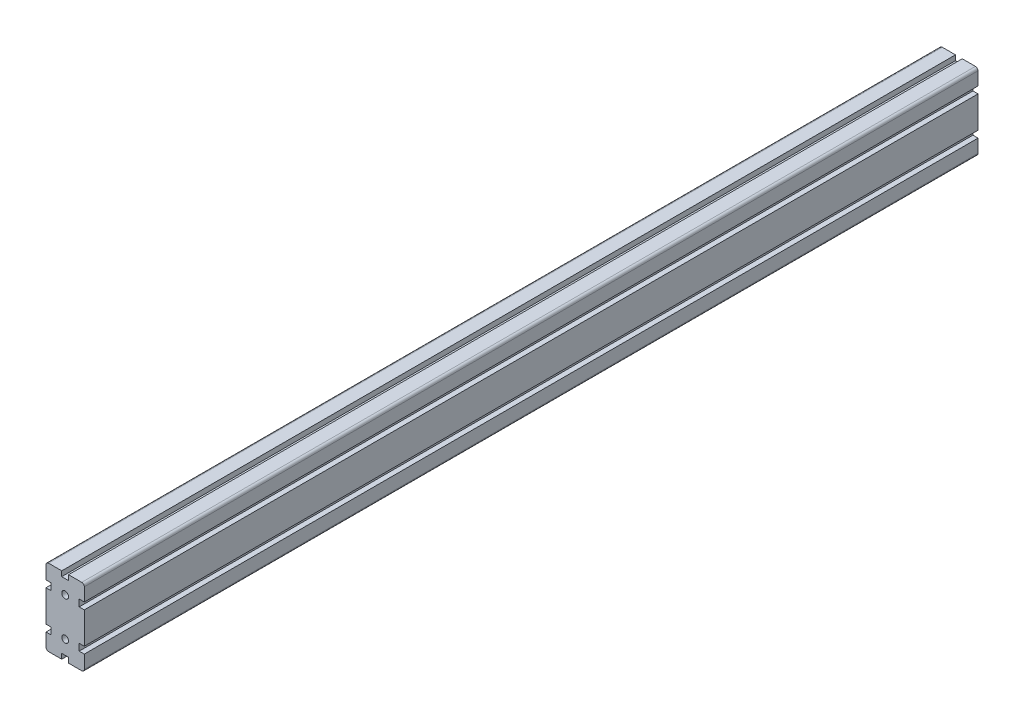
ISO-10303-21;
HEADER;
FILE_DESCRIPTION(('STEP AP214'),'2;1');
FILE_NAME('part.step','',(''),(''),'','','');
FILE_SCHEMA(('AUTOMOTIVE_DESIGN { 1 0 10303 214 1 1 1 1 }'));
ENDSEC;
DATA;
#1=APPLICATION_CONTEXT('core data for automotive mechanical design processes');
#2=APPLICATION_PROTOCOL_DEFINITION('international standard','automotive_design',2000,#1);
#3=PRODUCT_CONTEXT('',#1,'mechanical');
#4=PRODUCT('Part','Part','',(#3));
#5=PRODUCT_RELATED_PRODUCT_CATEGORY('part','',(#4));
#6=PRODUCT_DEFINITION_FORMATION('','',#4);
#7=PRODUCT_DEFINITION_CONTEXT('part definition',#1,'design');
#8=PRODUCT_DEFINITION('design','',#6,#7);
#9=PRODUCT_DEFINITION_SHAPE('','',#8);
#10=(LENGTH_UNIT() NAMED_UNIT(*) SI_UNIT(.MILLI.,.METRE.));
#11=(NAMED_UNIT(*) PLANE_ANGLE_UNIT() SI_UNIT($,.RADIAN.));
#12=(NAMED_UNIT(*) SI_UNIT($,.STERADIAN.) SOLID_ANGLE_UNIT());
#13=UNCERTAINTY_MEASURE_WITH_UNIT(LENGTH_MEASURE(1.E-05),#10,'distance_accuracy_value','');
#14=(GEOMETRIC_REPRESENTATION_CONTEXT(3) GLOBAL_UNCERTAINTY_ASSIGNED_CONTEXT((#13)) GLOBAL_UNIT_ASSIGNED_CONTEXT((#10,
#11,#12)) REPRESENTATION_CONTEXT('',''));
#15=CARTESIAN_POINT('',(0.,0.,0.));
#16=DIRECTION('',(0.,0.,1.));
#17=DIRECTION('',(1.,0.,0.));
#18=AXIS2_PLACEMENT_3D('',#15,#16,#17);
#19=CARTESIAN_POINT('',(-16.5000000000007,26.5000000000001,50.));
#20=DIRECTION('',(-1.,0.,0.));
#21=DIRECTION('',(0.,0.,1.));
#22=AXIS2_PLACEMENT_3D('',#19,#20,#21);
#23=PLANE('',#22);
#24=DIRECTION('',(0.,1.,0.));
#25=VECTOR('',#24,1.);
#26=CARTESIAN_POINT('',(-16.5000000000007,26.5000000000001,-1000.));
#27=LINE('',#26,#25);
#28=CARTESIAN_POINT('',(-16.5000000000007,18.4999999999999,-1000.));
#29=VERTEX_POINT('',#28);
#30=CARTESIAN_POINT('',(-16.5000000000007,26.5000000000001,-1000.));
#31=VERTEX_POINT('',#30);
#32=EDGE_CURVE('E274',#29,#31,#27,.T.);
#33=ORIENTED_EDGE('',*,*,#32,.F.);
#34=DIRECTION('',(0.,0.,-1.));
#35=VECTOR('',#34,1.);
#36=CARTESIAN_POINT('',(-16.5000000000007,18.4999999999999,50.));
#37=LINE('',#36,#35);
#38=CARTESIAN_POINT('',(-16.5000000000007,18.4999999999999,50.));
#39=VERTEX_POINT('',#38);
#40=EDGE_CURVE('E11',#39,#29,#37,.T.);
#41=ORIENTED_EDGE('',*,*,#40,.F.);
#42=DIRECTION('',(0.,1.,0.));
#43=VECTOR('',#42,1.);
#44=CARTESIAN_POINT('',(-16.5000000000007,26.5000000000001,50.));
#45=LINE('',#44,#43);
#46=CARTESIAN_POINT('',(-16.5000000000007,26.5000000000001,50.));
#47=VERTEX_POINT('',#46);
#48=EDGE_CURVE('E367',#39,#47,#45,.T.);
#49=ORIENTED_EDGE('',*,*,#48,.T.);
#50=DIRECTION('',(0.,0.,-1.));
#51=VECTOR('',#50,1.);
#52=CARTESIAN_POINT('',(-16.5000000000007,26.5000000000001,50.));
#53=LINE('',#52,#51);
#54=EDGE_CURVE('E36',#47,#31,#53,.T.);
#55=ORIENTED_EDGE('',*,*,#54,.T.);
#56=EDGE_LOOP('',(#33,#41,#49,#55));
#57=FACE_BOUND('',#56,.T.);
#58=ADVANCED_FACE('F33',(#57),#23,.T.);
#59=CARTESIAN_POINT('',(-22.5,18.4999999999999,50.));
#60=DIRECTION('',(0.,1.,0.));
#61=DIRECTION('',(0.,0.,1.));
#62=AXIS2_PLACEMENT_3D('',#59,#60,#61);
#63=PLANE('',#62);
#64=DIRECTION('',(1.,0.,0.));
#65=VECTOR('',#64,1.);
#66=CARTESIAN_POINT('',(-22.5,18.4999999999999,-1000.));
#67=LINE('',#66,#65);
#68=CARTESIAN_POINT('',(-22.5,18.4999999999999,-1000.));
#69=VERTEX_POINT('',#68);
#70=EDGE_CURVE('E365',#69,#29,#67,.T.);
#71=ORIENTED_EDGE('',*,*,#70,.F.);
#72=DIRECTION('',(0.,0.,-1.));
#73=VECTOR('',#72,1.);
#74=CARTESIAN_POINT('',(-22.5,18.4999999999999,50.));
#75=LINE('',#74,#73);
#76=CARTESIAN_POINT('',(-22.5,18.4999999999999,50.));
#77=VERTEX_POINT('',#76);
#78=EDGE_CURVE('E42',#77,#69,#75,.T.);
#79=ORIENTED_EDGE('',*,*,#78,.F.);
#80=DIRECTION('',(1.,0.,0.));
#81=VECTOR('',#80,1.);
#82=CARTESIAN_POINT('',(-22.5,18.4999999999999,50.));
#83=LINE('',#82,#81);
#84=EDGE_CURVE('E264',#77,#39,#83,.T.);
#85=ORIENTED_EDGE('',*,*,#84,.T.);
#86=ORIENTED_EDGE('',*,*,#40,.T.);
#87=EDGE_LOOP('',(#71,#79,#85,#86));
#88=FACE_BOUND('',#87,.T.);
#89=ADVANCED_FACE('F427',(#88),#63,.T.);
#90=CARTESIAN_POINT('',(-22.5,-18.5,50.));
#91=DIRECTION('',(-1.,0.,0.));
#92=DIRECTION('',(0.,-1.,0.));
#93=AXIS2_PLACEMENT_3D('',#90,#91,#92);
#94=PLANE('',#93);
#95=DIRECTION('',(0.,1.,0.));
#96=VECTOR('',#95,1.);
#97=CARTESIAN_POINT('',(-22.5,-18.5,-1000.));
#98=LINE('',#97,#96);
#99=CARTESIAN_POINT('',(-22.5,-18.5,-1000.));
#100=VERTEX_POINT('',#99);
#101=EDGE_CURVE('E251',#100,#69,#98,.T.);
#102=ORIENTED_EDGE('',*,*,#101,.F.);
#103=DIRECTION('',(0.,0.,-1.));
#104=VECTOR('',#103,1.);
#105=CARTESIAN_POINT('',(-22.5,-18.5,50.));
#106=LINE('',#105,#104);
#107=CARTESIAN_POINT('',(-22.5,-18.5,50.));
#108=VERTEX_POINT('',#107);
#109=EDGE_CURVE('E246',#108,#100,#106,.T.);
#110=ORIENTED_EDGE('',*,*,#109,.F.);
#111=DIRECTION('',(0.,1.,0.));
#112=VECTOR('',#111,1.);
#113=CARTESIAN_POINT('',(-22.5,-18.5,50.));
#114=LINE('',#113,#112);
#115=EDGE_CURVE('E249',#108,#77,#114,.T.);
#116=ORIENTED_EDGE('',*,*,#115,.T.);
#117=ORIENTED_EDGE('',*,*,#78,.T.);
#118=EDGE_LOOP('',(#102,#110,#116,#117));
#119=FACE_BOUND('',#118,.T.);
#120=ADVANCED_FACE('F248',(#119),#94,.T.);
#121=CARTESIAN_POINT('',(-16.5000000000017,-18.5,50.));
#122=DIRECTION('',(0.,-1.,0.));
#123=DIRECTION('',(0.,0.,-1.));
#124=AXIS2_PLACEMENT_3D('',#121,#122,#123);
#125=PLANE('',#124);
#126=DIRECTION('',(-1.,0.,0.));
#127=VECTOR('',#126,1.);
#128=CARTESIAN_POINT('',(-16.5000000000017,-18.5,-1000.));
#129=LINE('',#128,#127);
#130=CARTESIAN_POINT('',(-16.5000000000017,-18.5,-1000.));
#131=VERTEX_POINT('',#130);
#132=EDGE_CURVE('E362',#131,#100,#129,.T.);
#133=ORIENTED_EDGE('',*,*,#132,.F.);
#134=DIRECTION('',(0.,0.,-1.));
#135=VECTOR('',#134,1.);
#136=CARTESIAN_POINT('',(-16.5000000000017,-18.5,50.));
#137=LINE('',#136,#135);
#138=CARTESIAN_POINT('',(-16.5000000000017,-18.5,50.));
#139=VERTEX_POINT('',#138);
#140=EDGE_CURVE('E256',#139,#131,#137,.T.);
#141=ORIENTED_EDGE('',*,*,#140,.F.);
#142=DIRECTION('',(-1.,0.,0.));
#143=VECTOR('',#142,1.);
#144=CARTESIAN_POINT('',(-16.5000000000017,-18.5,50.));
#145=LINE('',#144,#143);
#146=EDGE_CURVE('E262',#139,#108,#145,.T.);
#147=ORIENTED_EDGE('',*,*,#146,.T.);
#148=ORIENTED_EDGE('',*,*,#109,.T.);
#149=EDGE_LOOP('',(#133,#141,#147,#148));
#150=FACE_BOUND('',#149,.T.);
#151=ADVANCED_FACE('F266',(#150),#125,.T.);
#152=CARTESIAN_POINT('',(-16.5000000000017,-18.5,50.));
#153=DIRECTION('',(-1.,0.,0.));
#154=DIRECTION('',(0.,0.,1.));
#155=AXIS2_PLACEMENT_3D('',#152,#153,#154);
#156=PLANE('',#155);
#157=DIRECTION('',(0.,1.,0.));
#158=VECTOR('',#157,1.);
#159=CARTESIAN_POINT('',(-16.5000000000017,-18.5,-1000.));
#160=LINE('',#159,#158);
#161=CARTESIAN_POINT('',(-16.5000000000017,-26.5,-1000.));
#162=VERTEX_POINT('',#161);
#163=EDGE_CURVE('E359',#162,#131,#160,.T.);
#164=ORIENTED_EDGE('',*,*,#163,.F.);
#165=DIRECTION('',(0.,0.,-1.));
#166=VECTOR('',#165,1.);
#167=CARTESIAN_POINT('',(-16.5000000000017,-26.5,50.));
#168=LINE('',#167,#166);
#169=CARTESIAN_POINT('',(-16.5000000000017,-26.5,50.));
#170=VERTEX_POINT('',#169);
#171=EDGE_CURVE('E371',#170,#162,#168,.T.);
#172=ORIENTED_EDGE('',*,*,#171,.F.);
#173=DIRECTION('',(0.,1.,0.));
#174=VECTOR('',#173,1.);
#175=CARTESIAN_POINT('',(-16.5000000000017,-18.5,50.));
#176=LINE('',#175,#174);
#177=EDGE_CURVE('E267',#170,#139,#176,.T.);
#178=ORIENTED_EDGE('',*,*,#177,.T.);
#179=ORIENTED_EDGE('',*,*,#140,.T.);
#180=EDGE_LOOP('',(#164,#172,#178,#179));
#181=FACE_BOUND('',#180,.T.);
#182=ADVANCED_FACE('F440',(#181),#156,.T.);
#183=CARTESIAN_POINT('',(-22.5,-26.5,50.));
#184=DIRECTION('',(0.,1.,0.));
#185=DIRECTION('',(0.,0.,1.));
#186=AXIS2_PLACEMENT_3D('',#183,#184,#185);
#187=PLANE('',#186);
#188=DIRECTION('',(1.,0.,0.));
#189=VECTOR('',#188,1.);
#190=CARTESIAN_POINT('',(-22.5,-26.5,-1000.));
#191=LINE('',#190,#189);
#192=CARTESIAN_POINT('',(-22.5,-26.5,-1000.));
#193=VERTEX_POINT('',#192);
#194=EDGE_CURVE('E356',#193,#162,#191,.T.);
#195=ORIENTED_EDGE('',*,*,#194,.F.);
#196=DIRECTION('',(0.,0.,-1.));
#197=VECTOR('',#196,1.);
#198=CARTESIAN_POINT('',(-22.5,-26.5,50.));
#199=LINE('',#198,#197);
#200=CARTESIAN_POINT('',(-22.5,-26.5,50.));
#201=VERTEX_POINT('',#200);
#202=EDGE_CURVE('E373',#201,#193,#199,.T.);
#203=ORIENTED_EDGE('',*,*,#202,.F.);
#204=DIRECTION('',(1.,0.,0.));
#205=VECTOR('',#204,1.);
#206=CARTESIAN_POINT('',(-22.5,-26.5,50.));
#207=LINE('',#206,#205);
#208=EDGE_CURVE('E269',#201,#170,#207,.T.);
#209=ORIENTED_EDGE('',*,*,#208,.T.);
#210=ORIENTED_EDGE('',*,*,#171,.T.);
#211=EDGE_LOOP('',(#195,#203,#209,#210));
#212=FACE_BOUND('',#211,.T.);
#213=ADVANCED_FACE('F443',(#212),#187,.T.);
#214=CARTESIAN_POINT('',(-22.5,-42.,50.));
#215=DIRECTION('',(-1.,0.,0.));
#216=DIRECTION('',(0.,0.,1.));
#217=AXIS2_PLACEMENT_3D('',#214,#215,#216);
#218=PLANE('',#217);
#219=DIRECTION('',(0.,1.,0.));
#220=VECTOR('',#219,1.);
#221=CARTESIAN_POINT('',(-22.5,-42.,-1000.));
#222=LINE('',#221,#220);
#223=CARTESIAN_POINT('',(-22.5,-42.,-1000.));
#224=VERTEX_POINT('',#223);
#225=EDGE_CURVE('E353',#224,#193,#222,.T.);
#226=ORIENTED_EDGE('',*,*,#225,.F.);
#227=DIRECTION('',(0.,0.,-1.));
#228=VECTOR('',#227,1.);
#229=CARTESIAN_POINT('',(-22.5,-42.,50.));
#230=LINE('',#229,#228);
#231=CARTESIAN_POINT('',(-22.5,-42.,50.));
#232=VERTEX_POINT('',#231);
#233=EDGE_CURVE('E375',#232,#224,#230,.T.);
#234=ORIENTED_EDGE('',*,*,#233,.F.);
#235=DIRECTION('',(0.,1.,0.));
#236=VECTOR('',#235,1.);
#237=CARTESIAN_POINT('',(-22.5,-42.,50.));
#238=LINE('',#237,#236);
#239=EDGE_CURVE('E657',#232,#201,#238,.T.);
#240=ORIENTED_EDGE('',*,*,#239,.T.);
#241=ORIENTED_EDGE('',*,*,#202,.T.);
#242=EDGE_LOOP('',(#226,#234,#240,#241));
#243=FACE_BOUND('',#242,.T.);
#244=ADVANCED_FACE('F447',(#243),#218,.T.);
#245=CARTESIAN_POINT('',(-19.5000000000004,-42.,50.));
#246=DIRECTION('',(0.,0.,-1.));
#247=DIRECTION('',(-1.,0.,0.));
#248=AXIS2_PLACEMENT_3D('',#245,#246,#247);
#249=CYLINDRICAL_SURFACE('',#248,2.99999999999956);
#250=CARTESIAN_POINT('',(-19.5000000000004,-42.,-1000.));
#251=DIRECTION('',(0.,0.,-1.));
#252=DIRECTION('',(-1.,0.,0.));
#253=AXIS2_PLACEMENT_3D('',#250,#251,#252);
#254=CIRCLE('',#253,2.99999999999956);
#255=CARTESIAN_POINT('',(-19.5000000000004,-44.9999999999996,-1000.));
#256=VERTEX_POINT('',#255);
#257=EDGE_CURVE('E350',#256,#224,#254,.T.);
#258=ORIENTED_EDGE('',*,*,#257,.F.);
#259=DIRECTION('',(0.,0.,-1.));
#260=VECTOR('',#259,1.);
#261=CARTESIAN_POINT('',(-19.5000000000004,-44.9999999999996,50.));
#262=LINE('',#261,#260);
#263=CARTESIAN_POINT('',(-19.5000000000004,-44.9999999999996,50.));
#264=VERTEX_POINT('',#263);
#265=EDGE_CURVE('E377',#264,#256,#262,.T.);
#266=ORIENTED_EDGE('',*,*,#265,.F.);
#267=CARTESIAN_POINT('',(-19.5000000000004,-42.,50.));
#268=DIRECTION('',(0.,0.,-1.));
#269=DIRECTION('',(-1.,0.,0.));
#270=AXIS2_PLACEMENT_3D('',#267,#268,#269);
#271=CIRCLE('',#270,2.99999999999956);
#272=EDGE_CURVE('E654',#264,#232,#271,.T.);
#273=ORIENTED_EDGE('',*,*,#272,.T.);
#274=ORIENTED_EDGE('',*,*,#233,.T.);
#275=EDGE_LOOP('',(#258,#266,#273,#274));
#276=FACE_BOUND('',#275,.T.);
#277=ADVANCED_FACE('F451',(#276),#249,.T.);
#278=CARTESIAN_POINT('',(-4.00000000000001,-44.9999999999996,50.));
#279=DIRECTION('',(0.,-1.,0.));
#280=DIRECTION('',(0.,0.,-1.));
#281=AXIS2_PLACEMENT_3D('',#278,#279,#280);
#282=PLANE('',#281);
#283=DIRECTION('',(-1.,0.,0.));
#284=VECTOR('',#283,1.);
#285=CARTESIAN_POINT('',(-4.00000000000001,-44.9999999999996,-1000.));
#286=LINE('',#285,#284);
#287=CARTESIAN_POINT('',(-4.00000000000001,-44.9999999999996,-1000.));
#288=VERTEX_POINT('',#287);
#289=EDGE_CURVE('E347',#288,#256,#286,.T.);
#290=ORIENTED_EDGE('',*,*,#289,.F.);
#291=DIRECTION('',(0.,0.,-1.));
#292=VECTOR('',#291,1.);
#293=CARTESIAN_POINT('',(-4.00000000000001,-44.9999999999996,50.));
#294=LINE('',#293,#292);
#295=CARTESIAN_POINT('',(-4.00000000000001,-44.9999999999996,50.));
#296=VERTEX_POINT('',#295);
#297=EDGE_CURVE('E379',#296,#288,#294,.T.);
#298=ORIENTED_EDGE('',*,*,#297,.F.);
#299=DIRECTION('',(-1.,0.,0.));
#300=VECTOR('',#299,1.);
#301=CARTESIAN_POINT('',(-4.00000000000001,-44.9999999999996,50.));
#302=LINE('',#301,#300);
#303=EDGE_CURVE('E651',#296,#264,#302,.T.);
#304=ORIENTED_EDGE('',*,*,#303,.T.);
#305=ORIENTED_EDGE('',*,*,#265,.T.);
#306=EDGE_LOOP('',(#290,#298,#304,#305));
#307=FACE_BOUND('',#306,.T.);
#308=ADVANCED_FACE('F455',(#307),#282,.T.);
#309=CARTESIAN_POINT('',(-4.00000000000001,-39.,50.));
#310=DIRECTION('',(1.,0.,0.));
#311=DIRECTION('',(0.,1.,0.));
#312=AXIS2_PLACEMENT_3D('',#309,#310,#311);
#313=PLANE('',#312);
#314=DIRECTION('',(0.,-1.,0.));
#315=VECTOR('',#314,1.);
#316=CARTESIAN_POINT('',(-4.00000000000001,-39.,-1000.));
#317=LINE('',#316,#315);
#318=CARTESIAN_POINT('',(-4.00000000000001,-39.,-1000.));
#319=VERTEX_POINT('',#318);
#320=EDGE_CURVE('E344',#319,#288,#317,.T.);
#321=ORIENTED_EDGE('',*,*,#320,.F.);
#322=DIRECTION('',(0.,0.,-1.));
#323=VECTOR('',#322,1.);
#324=CARTESIAN_POINT('',(-4.00000000000001,-39.,50.));
#325=LINE('',#324,#323);
#326=CARTESIAN_POINT('',(-4.00000000000001,-39.,50.));
#327=VERTEX_POINT('',#326);
#328=EDGE_CURVE('E381',#327,#319,#325,.T.);
#329=ORIENTED_EDGE('',*,*,#328,.F.);
#330=DIRECTION('',(0.,-1.,0.));
#331=VECTOR('',#330,1.);
#332=CARTESIAN_POINT('',(-4.00000000000001,-39.,50.));
#333=LINE('',#332,#331);
#334=EDGE_CURVE('E648',#327,#296,#333,.T.);
#335=ORIENTED_EDGE('',*,*,#334,.T.);
#336=ORIENTED_EDGE('',*,*,#297,.T.);
#337=EDGE_LOOP('',(#321,#329,#335,#336));
#338=FACE_BOUND('',#337,.T.);
#339=ADVANCED_FACE('F459',(#338),#313,.T.);
#340=CARTESIAN_POINT('',(3.99999999999999,-39.,50.));
#341=DIRECTION('',(0.,-1.,0.));
#342=DIRECTION('',(0.,0.,-1.));
#343=AXIS2_PLACEMENT_3D('',#340,#341,#342);
#344=PLANE('',#343);
#345=DIRECTION('',(-1.,0.,0.));
#346=VECTOR('',#345,1.);
#347=CARTESIAN_POINT('',(3.99999999999999,-39.,-1000.));
#348=LINE('',#347,#346);
#349=CARTESIAN_POINT('',(3.99999999999999,-39.,-1000.));
#350=VERTEX_POINT('',#349);
#351=EDGE_CURVE('E341',#350,#319,#348,.T.);
#352=ORIENTED_EDGE('',*,*,#351,.F.);
#353=DIRECTION('',(0.,0.,-1.));
#354=VECTOR('',#353,1.);
#355=CARTESIAN_POINT('',(3.99999999999999,-39.,50.));
#356=LINE('',#355,#354);
#357=CARTESIAN_POINT('',(3.99999999999999,-39.,50.));
#358=VERTEX_POINT('',#357);
#359=EDGE_CURVE('E383',#358,#350,#356,.T.);
#360=ORIENTED_EDGE('',*,*,#359,.F.);
#361=DIRECTION('',(-1.,0.,0.));
#362=VECTOR('',#361,1.);
#363=CARTESIAN_POINT('',(3.99999999999999,-39.,50.));
#364=LINE('',#363,#362);
#365=EDGE_CURVE('E645',#358,#327,#364,.T.);
#366=ORIENTED_EDGE('',*,*,#365,.T.);
#367=ORIENTED_EDGE('',*,*,#328,.T.);
#368=EDGE_LOOP('',(#352,#360,#366,#367));
#369=FACE_BOUND('',#368,.T.);
#370=ADVANCED_FACE('F463',(#369),#344,.T.);
#371=CARTESIAN_POINT('',(3.99999999999999,-44.9999999999996,50.));
#372=DIRECTION('',(-1.,0.,0.));
#373=DIRECTION('',(0.,-1.,0.));
#374=AXIS2_PLACEMENT_3D('',#371,#372,#373);
#375=PLANE('',#374);
#376=DIRECTION('',(0.,1.,0.));
#377=VECTOR('',#376,1.);
#378=CARTESIAN_POINT('',(3.99999999999999,-44.9999999999996,-1000.));
#379=LINE('',#378,#377);
#380=CARTESIAN_POINT('',(3.99999999999999,-44.9999999999996,-1000.));
#381=VERTEX_POINT('',#380);
#382=EDGE_CURVE('E338',#381,#350,#379,.T.);
#383=ORIENTED_EDGE('',*,*,#382,.F.);
#384=DIRECTION('',(0.,0.,-1.));
#385=VECTOR('',#384,1.);
#386=CARTESIAN_POINT('',(3.99999999999999,-44.9999999999996,50.));
#387=LINE('',#386,#385);
#388=CARTESIAN_POINT('',(3.99999999999999,-44.9999999999996,50.));
#389=VERTEX_POINT('',#388);
#390=EDGE_CURVE('E385',#389,#381,#387,.T.);
#391=ORIENTED_EDGE('',*,*,#390,.F.);
#392=DIRECTION('',(0.,1.,0.));
#393=VECTOR('',#392,1.);
#394=CARTESIAN_POINT('',(3.99999999999999,-44.9999999999996,50.));
#395=LINE('',#394,#393);
#396=EDGE_CURVE('E642',#389,#358,#395,.T.);
#397=ORIENTED_EDGE('',*,*,#396,.T.);
#398=ORIENTED_EDGE('',*,*,#359,.T.);
#399=EDGE_LOOP('',(#383,#391,#397,#398));
#400=FACE_BOUND('',#399,.T.);
#401=ADVANCED_FACE('F467',(#400),#375,.T.);
#402=CARTESIAN_POINT('',(19.4999999999996,-44.9999999999996,50.));
#403=DIRECTION('',(0.,-1.,0.));
#404=DIRECTION('',(0.,0.,-1.));
#405=AXIS2_PLACEMENT_3D('',#402,#403,#404);
#406=PLANE('',#405);
#407=DIRECTION('',(-1.,0.,0.));
#408=VECTOR('',#407,1.);
#409=CARTESIAN_POINT('',(19.4999999999996,-44.9999999999996,-1000.));
#410=LINE('',#409,#408);
#411=CARTESIAN_POINT('',(19.4999999999996,-44.9999999999996,-1000.));
#412=VERTEX_POINT('',#411);
#413=EDGE_CURVE('E335',#412,#381,#410,.T.);
#414=ORIENTED_EDGE('',*,*,#413,.F.);
#415=DIRECTION('',(0.,0.,-1.));
#416=VECTOR('',#415,1.);
#417=CARTESIAN_POINT('',(19.4999999999996,-44.9999999999996,50.));
#418=LINE('',#417,#416);
#419=CARTESIAN_POINT('',(19.4999999999996,-44.9999999999996,50.));
#420=VERTEX_POINT('',#419);
#421=EDGE_CURVE('E387',#420,#412,#418,.T.);
#422=ORIENTED_EDGE('',*,*,#421,.F.);
#423=DIRECTION('',(-1.,0.,0.));
#424=VECTOR('',#423,1.);
#425=CARTESIAN_POINT('',(19.4999999999996,-44.9999999999996,50.));
#426=LINE('',#425,#424);
#427=EDGE_CURVE('E639',#420,#389,#426,.T.);
#428=ORIENTED_EDGE('',*,*,#427,.T.);
#429=ORIENTED_EDGE('',*,*,#390,.T.);
#430=EDGE_LOOP('',(#414,#422,#428,#429));
#431=FACE_BOUND('',#430,.T.);
#432=ADVANCED_FACE('F471',(#431),#406,.T.);
#433=CARTESIAN_POINT('',(19.4999999999996,-41.9999999999999,50.));
#434=DIRECTION('',(0.,0.,-1.));
#435=DIRECTION('',(-1.,0.,0.));
#436=AXIS2_PLACEMENT_3D('',#433,#434,#435);
#437=CYLINDRICAL_SURFACE('',#436,2.9999999999997);
#438=CARTESIAN_POINT('',(19.4999999999996,-41.9999999999999,-1000.));
#439=DIRECTION('',(0.,0.,-1.));
#440=DIRECTION('',(-1.,0.,0.));
#441=AXIS2_PLACEMENT_3D('',#438,#439,#440);
#442=CIRCLE('',#441,2.9999999999997);
#443=CARTESIAN_POINT('',(22.4999999999993,-41.9999999999999,-1000.));
#444=VERTEX_POINT('',#443);
#445=EDGE_CURVE('E332',#444,#412,#442,.T.);
#446=ORIENTED_EDGE('',*,*,#445,.F.);
#447=DIRECTION('',(0.,0.,-1.));
#448=VECTOR('',#447,1.);
#449=CARTESIAN_POINT('',(22.4999999999993,-41.9999999999999,50.));
#450=LINE('',#449,#448);
#451=CARTESIAN_POINT('',(22.4999999999993,-41.9999999999999,50.));
#452=VERTEX_POINT('',#451);
#453=EDGE_CURVE('E389',#452,#444,#450,.T.);
#454=ORIENTED_EDGE('',*,*,#453,.F.);
#455=CARTESIAN_POINT('',(19.4999999999996,-41.9999999999999,50.));
#456=DIRECTION('',(0.,0.,-1.));
#457=DIRECTION('',(-1.,0.,0.));
#458=AXIS2_PLACEMENT_3D('',#455,#456,#457);
#459=CIRCLE('',#458,2.9999999999997);
#460=EDGE_CURVE('E636',#452,#420,#459,.T.);
#461=ORIENTED_EDGE('',*,*,#460,.T.);
#462=ORIENTED_EDGE('',*,*,#421,.T.);
#463=EDGE_LOOP('',(#446,#454,#461,#462));
#464=FACE_BOUND('',#463,.T.);
#465=ADVANCED_FACE('F475',(#464),#437,.T.);
#466=CARTESIAN_POINT('',(22.4999999999993,-26.5,50.));
#467=DIRECTION('',(1.,0.,0.));
#468=DIRECTION('',(0.,1.,0.));
#469=AXIS2_PLACEMENT_3D('',#466,#467,#468);
#470=PLANE('',#469);
#471=DIRECTION('',(0.,-1.,0.));
#472=VECTOR('',#471,1.);
#473=CARTESIAN_POINT('',(22.4999999999993,-26.5,-1000.));
#474=LINE('',#473,#472);
#475=CARTESIAN_POINT('',(22.4999999999993,-26.5,-1000.));
#476=VERTEX_POINT('',#475);
#477=EDGE_CURVE('E329',#476,#444,#474,.T.);
#478=ORIENTED_EDGE('',*,*,#477,.F.);
#479=DIRECTION('',(0.,0.,-1.));
#480=VECTOR('',#479,1.);
#481=CARTESIAN_POINT('',(22.4999999999993,-26.5,50.));
#482=LINE('',#481,#480);
#483=CARTESIAN_POINT('',(22.4999999999993,-26.5,50.));
#484=VERTEX_POINT('',#483);
#485=EDGE_CURVE('E391',#484,#476,#482,.T.);
#486=ORIENTED_EDGE('',*,*,#485,.F.);
#487=DIRECTION('',(0.,-1.,0.));
#488=VECTOR('',#487,1.);
#489=CARTESIAN_POINT('',(22.4999999999993,-26.5,50.));
#490=LINE('',#489,#488);
#491=EDGE_CURVE('E633',#484,#452,#490,.T.);
#492=ORIENTED_EDGE('',*,*,#491,.T.);
#493=ORIENTED_EDGE('',*,*,#453,.T.);
#494=EDGE_LOOP('',(#478,#486,#492,#493));
#495=FACE_BOUND('',#494,.T.);
#496=ADVANCED_FACE('F479',(#495),#470,.T.);
#497=CARTESIAN_POINT('',(16.4999999999983,-26.5,50.));
#498=DIRECTION('',(0.,1.,0.));
#499=DIRECTION('',(0.,0.,1.));
#500=AXIS2_PLACEMENT_3D('',#497,#498,#499);
#501=PLANE('',#500);
#502=DIRECTION('',(1.,0.,0.));
#503=VECTOR('',#502,1.);
#504=CARTESIAN_POINT('',(16.4999999999983,-26.5,-1000.));
#505=LINE('',#504,#503);
#506=CARTESIAN_POINT('',(16.4999999999983,-26.5,-1000.));
#507=VERTEX_POINT('',#506);
#508=EDGE_CURVE('E326',#507,#476,#505,.T.);
#509=ORIENTED_EDGE('',*,*,#508,.F.);
#510=DIRECTION('',(0.,0.,-1.));
#511=VECTOR('',#510,1.);
#512=CARTESIAN_POINT('',(16.4999999999983,-26.5,50.));
#513=LINE('',#512,#511);
#514=CARTESIAN_POINT('',(16.4999999999983,-26.5,50.));
#515=VERTEX_POINT('',#514);
#516=EDGE_CURVE('E393',#515,#507,#513,.T.);
#517=ORIENTED_EDGE('',*,*,#516,.F.);
#518=DIRECTION('',(1.,0.,0.));
#519=VECTOR('',#518,1.);
#520=CARTESIAN_POINT('',(16.4999999999983,-26.5,50.));
#521=LINE('',#520,#519);
#522=EDGE_CURVE('E630',#515,#484,#521,.T.);
#523=ORIENTED_EDGE('',*,*,#522,.T.);
#524=ORIENTED_EDGE('',*,*,#485,.T.);
#525=EDGE_LOOP('',(#509,#517,#523,#524));
#526=FACE_BOUND('',#525,.T.);
#527=ADVANCED_FACE('F483',(#526),#501,.T.);
#528=CARTESIAN_POINT('',(16.4999999999983,-18.5,50.));
#529=DIRECTION('',(1.,0.,0.));
#530=DIRECTION('',(0.,0.,-1.));
#531=AXIS2_PLACEMENT_3D('',#528,#529,#530);
#532=PLANE('',#531);
#533=DIRECTION('',(0.,-1.,0.));
#534=VECTOR('',#533,1.);
#535=CARTESIAN_POINT('',(16.4999999999983,-18.5,-1000.));
#536=LINE('',#535,#534);
#537=CARTESIAN_POINT('',(16.4999999999983,-18.5,-1000.));
#538=VERTEX_POINT('',#537);
#539=EDGE_CURVE('E323',#538,#507,#536,.T.);
#540=ORIENTED_EDGE('',*,*,#539,.F.);
#541=DIRECTION('',(0.,0.,-1.));
#542=VECTOR('',#541,1.);
#543=CARTESIAN_POINT('',(16.4999999999983,-18.5,50.));
#544=LINE('',#543,#542);
#545=CARTESIAN_POINT('',(16.4999999999983,-18.5,50.));
#546=VERTEX_POINT('',#545);
#547=EDGE_CURVE('E395',#546,#538,#544,.T.);
#548=ORIENTED_EDGE('',*,*,#547,.F.);
#549=DIRECTION('',(0.,-1.,0.));
#550=VECTOR('',#549,1.);
#551=CARTESIAN_POINT('',(16.4999999999983,-18.5,50.));
#552=LINE('',#551,#550);
#553=EDGE_CURVE('E627',#546,#515,#552,.T.);
#554=ORIENTED_EDGE('',*,*,#553,.T.);
#555=ORIENTED_EDGE('',*,*,#516,.T.);
#556=EDGE_LOOP('',(#540,#548,#554,#555));
#557=FACE_BOUND('',#556,.T.);
#558=ADVANCED_FACE('F487',(#557),#532,.T.);
#559=CARTESIAN_POINT('',(22.4999999999993,-18.5,50.));
#560=DIRECTION('',(0.,-1.,0.));
#561=DIRECTION('',(0.,0.,-1.));
#562=AXIS2_PLACEMENT_3D('',#559,#560,#561);
#563=PLANE('',#562);
#564=DIRECTION('',(-1.,0.,0.));
#565=VECTOR('',#564,1.);
#566=CARTESIAN_POINT('',(22.4999999999993,-18.5,-1000.));
#567=LINE('',#566,#565);
#568=CARTESIAN_POINT('',(22.4999999999993,-18.5,-1000.));
#569=VERTEX_POINT('',#568);
#570=EDGE_CURVE('E320',#569,#538,#567,.T.);
#571=ORIENTED_EDGE('',*,*,#570,.F.);
#572=DIRECTION('',(0.,0.,-1.));
#573=VECTOR('',#572,1.);
#574=CARTESIAN_POINT('',(22.4999999999993,-18.5,50.));
#575=LINE('',#574,#573);
#576=CARTESIAN_POINT('',(22.4999999999993,-18.5,50.));
#577=VERTEX_POINT('',#576);
#578=EDGE_CURVE('E397',#577,#569,#575,.T.);
#579=ORIENTED_EDGE('',*,*,#578,.F.);
#580=DIRECTION('',(-1.,0.,0.));
#581=VECTOR('',#580,1.);
#582=CARTESIAN_POINT('',(22.4999999999993,-18.5,50.));
#583=LINE('',#582,#581);
#584=EDGE_CURVE('E624',#577,#546,#583,.T.);
#585=ORIENTED_EDGE('',*,*,#584,.T.);
#586=ORIENTED_EDGE('',*,*,#547,.T.);
#587=EDGE_LOOP('',(#571,#579,#585,#586));
#588=FACE_BOUND('',#587,.T.);
#589=ADVANCED_FACE('F491',(#588),#563,.T.);
#590=CARTESIAN_POINT('',(22.4999999999993,18.4999999999999,50.));
#591=DIRECTION('',(1.,0.,0.));
#592=DIRECTION('',(0.,1.,0.));
#593=AXIS2_PLACEMENT_3D('',#590,#591,#592);
#594=PLANE('',#593);
#595=DIRECTION('',(0.,-1.,0.));
#596=VECTOR('',#595,1.);
#597=CARTESIAN_POINT('',(22.4999999999993,18.4999999999999,-1000.));
#598=LINE('',#597,#596);
#599=CARTESIAN_POINT('',(22.4999999999993,18.4999999999999,-1000.));
#600=VERTEX_POINT('',#599);
#601=EDGE_CURVE('E317',#600,#569,#598,.T.);
#602=ORIENTED_EDGE('',*,*,#601,.F.);
#603=DIRECTION('',(0.,0.,-1.));
#604=VECTOR('',#603,1.);
#605=CARTESIAN_POINT('',(22.4999999999993,18.4999999999999,50.));
#606=LINE('',#605,#604);
#607=CARTESIAN_POINT('',(22.4999999999993,18.4999999999999,50.));
#608=VERTEX_POINT('',#607);
#609=EDGE_CURVE('E399',#608,#600,#606,.T.);
#610=ORIENTED_EDGE('',*,*,#609,.F.);
#611=DIRECTION('',(0.,-1.,0.));
#612=VECTOR('',#611,1.);
#613=CARTESIAN_POINT('',(22.4999999999993,18.4999999999999,50.));
#614=LINE('',#613,#612);
#615=EDGE_CURVE('E621',#608,#577,#614,.T.);
#616=ORIENTED_EDGE('',*,*,#615,.T.);
#617=ORIENTED_EDGE('',*,*,#578,.T.);
#618=EDGE_LOOP('',(#602,#610,#616,#617));
#619=FACE_BOUND('',#618,.T.);
#620=ADVANCED_FACE('F495',(#619),#594,.T.);
#621=CARTESIAN_POINT('',(16.4999999999993,18.4999999999999,50.));
#622=DIRECTION('',(0.,1.,0.));
#623=DIRECTION('',(0.,0.,1.));
#624=AXIS2_PLACEMENT_3D('',#621,#622,#623);
#625=PLANE('',#624);
#626=DIRECTION('',(1.,0.,0.));
#627=VECTOR('',#626,1.);
#628=CARTESIAN_POINT('',(16.4999999999993,18.4999999999999,-1000.));
#629=LINE('',#628,#627);
#630=CARTESIAN_POINT('',(16.4999999999993,18.4999999999999,-1000.));
#631=VERTEX_POINT('',#630);
#632=EDGE_CURVE('E314',#631,#600,#629,.T.);
#633=ORIENTED_EDGE('',*,*,#632,.F.);
#634=DIRECTION('',(0.,0.,-1.));
#635=VECTOR('',#634,1.);
#636=CARTESIAN_POINT('',(16.4999999999993,18.4999999999999,50.));
#637=LINE('',#636,#635);
#638=CARTESIAN_POINT('',(16.4999999999993,18.4999999999999,50.));
#639=VERTEX_POINT('',#638);
#640=EDGE_CURVE('E401',#639,#631,#637,.T.);
#641=ORIENTED_EDGE('',*,*,#640,.F.);
#642=DIRECTION('',(1.,0.,0.));
#643=VECTOR('',#642,1.);
#644=CARTESIAN_POINT('',(16.4999999999993,18.4999999999999,50.));
#645=LINE('',#644,#643);
#646=EDGE_CURVE('E618',#639,#608,#645,.T.);
#647=ORIENTED_EDGE('',*,*,#646,.T.);
#648=ORIENTED_EDGE('',*,*,#609,.T.);
#649=EDGE_LOOP('',(#633,#641,#647,#648));
#650=FACE_BOUND('',#649,.T.);
#651=ADVANCED_FACE('F499',(#650),#625,.T.);
#652=CARTESIAN_POINT('',(16.4999999999993,26.5000000000001,50.));
#653=DIRECTION('',(1.,0.,0.));
#654=DIRECTION('',(0.,0.,-1.));
#655=AXIS2_PLACEMENT_3D('',#652,#653,#654);
#656=PLANE('',#655);
#657=DIRECTION('',(0.,-1.,0.));
#658=VECTOR('',#657,1.);
#659=CARTESIAN_POINT('',(16.4999999999993,26.5000000000001,-1000.));
#660=LINE('',#659,#658);
#661=CARTESIAN_POINT('',(16.4999999999993,26.5000000000001,-1000.));
#662=VERTEX_POINT('',#661);
#663=EDGE_CURVE('E311',#662,#631,#660,.T.);
#664=ORIENTED_EDGE('',*,*,#663,.F.);
#665=DIRECTION('',(0.,0.,-1.));
#666=VECTOR('',#665,1.);
#667=CARTESIAN_POINT('',(16.4999999999993,26.5000000000001,50.));
#668=LINE('',#667,#666);
#669=CARTESIAN_POINT('',(16.4999999999993,26.5000000000001,50.));
#670=VERTEX_POINT('',#669);
#671=EDGE_CURVE('E403',#670,#662,#668,.T.);
#672=ORIENTED_EDGE('',*,*,#671,.F.);
#673=DIRECTION('',(0.,-1.,0.));
#674=VECTOR('',#673,1.);
#675=CARTESIAN_POINT('',(16.4999999999993,26.5000000000001,50.));
#676=LINE('',#675,#674);
#677=EDGE_CURVE('E615',#670,#639,#676,.T.);
#678=ORIENTED_EDGE('',*,*,#677,.T.);
#679=ORIENTED_EDGE('',*,*,#640,.T.);
#680=EDGE_LOOP('',(#664,#672,#678,#679));
#681=FACE_BOUND('',#680,.T.);
#682=ADVANCED_FACE('F503',(#681),#656,.T.);
#683=CARTESIAN_POINT('',(22.4999999999993,26.5000000000001,50.));
#684=DIRECTION('',(0.,-1.,0.));
#685=DIRECTION('',(0.,0.,-1.));
#686=AXIS2_PLACEMENT_3D('',#683,#684,#685);
#687=PLANE('',#686);
#688=DIRECTION('',(-1.,0.,0.));
#689=VECTOR('',#688,1.);
#690=CARTESIAN_POINT('',(22.4999999999993,26.5000000000001,-1000.));
#691=LINE('',#690,#689);
#692=CARTESIAN_POINT('',(22.4999999999993,26.5000000000001,-1000.));
#693=VERTEX_POINT('',#692);
#694=EDGE_CURVE('E308',#693,#662,#691,.T.);
#695=ORIENTED_EDGE('',*,*,#694,.F.);
#696=DIRECTION('',(0.,0.,-1.));
#697=VECTOR('',#696,1.);
#698=CARTESIAN_POINT('',(22.4999999999993,26.5000000000001,50.));
#699=LINE('',#698,#697);
#700=CARTESIAN_POINT('',(22.4999999999993,26.5000000000001,50.));
#701=VERTEX_POINT('',#700);
#702=EDGE_CURVE('E405',#701,#693,#699,.T.);
#703=ORIENTED_EDGE('',*,*,#702,.F.);
#704=DIRECTION('',(-1.,0.,0.));
#705=VECTOR('',#704,1.);
#706=CARTESIAN_POINT('',(22.4999999999993,26.5000000000001,50.));
#707=LINE('',#706,#705);
#708=EDGE_CURVE('E612',#701,#670,#707,.T.);
#709=ORIENTED_EDGE('',*,*,#708,.T.);
#710=ORIENTED_EDGE('',*,*,#671,.T.);
#711=EDGE_LOOP('',(#695,#703,#709,#710));
#712=FACE_BOUND('',#711,.T.);
#713=ADVANCED_FACE('F507',(#712),#687,.T.);
#714=CARTESIAN_POINT('',(22.4999999999993,42.0000000000001,50.));
#715=DIRECTION('',(1.,0.,0.));
#716=DIRECTION('',(0.,1.,0.));
#717=AXIS2_PLACEMENT_3D('',#714,#715,#716);
#718=PLANE('',#717);
#719=DIRECTION('',(0.,-1.,0.));
#720=VECTOR('',#719,1.);
#721=CARTESIAN_POINT('',(22.4999999999993,42.0000000000001,-1000.));
#722=LINE('',#721,#720);
#723=CARTESIAN_POINT('',(22.4999999999993,42.0000000000001,-1000.));
#724=VERTEX_POINT('',#723);
#725=EDGE_CURVE('E305',#724,#693,#722,.T.);
#726=ORIENTED_EDGE('',*,*,#725,.F.);
#727=DIRECTION('',(0.,0.,-1.));
#728=VECTOR('',#727,1.);
#729=CARTESIAN_POINT('',(22.4999999999993,42.0000000000001,50.));
#730=LINE('',#729,#728);
#731=CARTESIAN_POINT('',(22.4999999999993,42.0000000000001,50.));
#732=VERTEX_POINT('',#731);
#733=EDGE_CURVE('E407',#732,#724,#730,.T.);
#734=ORIENTED_EDGE('',*,*,#733,.F.);
#735=DIRECTION('',(0.,-1.,0.));
#736=VECTOR('',#735,1.);
#737=CARTESIAN_POINT('',(22.4999999999993,42.0000000000001,50.));
#738=LINE('',#737,#736);
#739=EDGE_CURVE('E609',#732,#701,#738,.T.);
#740=ORIENTED_EDGE('',*,*,#739,.T.);
#741=ORIENTED_EDGE('',*,*,#702,.T.);
#742=EDGE_LOOP('',(#726,#734,#740,#741));
#743=FACE_BOUND('',#742,.T.);
#744=ADVANCED_FACE('F511',(#743),#718,.T.);
#745=CARTESIAN_POINT('',(19.4999999999993,42.0000000000001,50.));
#746=DIRECTION('',(0.,0.,-1.));
#747=DIRECTION('',(-1.,0.,0.));
#748=AXIS2_PLACEMENT_3D('',#745,#746,#747);
#749=CYLINDRICAL_SURFACE('',#748,3.00000000000001);
#750=CARTESIAN_POINT('',(19.4999999999993,42.0000000000001,-1000.));
#751=DIRECTION('',(0.,0.,-1.));
#752=DIRECTION('',(-1.,0.,0.));
#753=AXIS2_PLACEMENT_3D('',#750,#751,#752);
#754=CIRCLE('',#753,3.00000000000001);
#755=CARTESIAN_POINT('',(19.4999999999993,45.0000000000001,-1000.));
#756=VERTEX_POINT('',#755);
#757=EDGE_CURVE('E302',#756,#724,#754,.T.);
#758=ORIENTED_EDGE('',*,*,#757,.F.);
#759=DIRECTION('',(0.,0.,-1.));
#760=VECTOR('',#759,1.);
#761=CARTESIAN_POINT('',(19.4999999999993,45.0000000000001,50.));
#762=LINE('',#761,#760);
#763=CARTESIAN_POINT('',(19.4999999999993,45.0000000000001,50.));
#764=VERTEX_POINT('',#763);
#765=EDGE_CURVE('E409',#764,#756,#762,.T.);
#766=ORIENTED_EDGE('',*,*,#765,.F.);
#767=CARTESIAN_POINT('',(19.4999999999993,42.0000000000001,50.));
#768=DIRECTION('',(0.,0.,-1.));
#769=DIRECTION('',(-1.,0.,0.));
#770=AXIS2_PLACEMENT_3D('',#767,#768,#769);
#771=CIRCLE('',#770,3.00000000000001);
#772=EDGE_CURVE('E606',#764,#732,#771,.T.);
#773=ORIENTED_EDGE('',*,*,#772,.T.);
#774=ORIENTED_EDGE('',*,*,#733,.T.);
#775=EDGE_LOOP('',(#758,#766,#773,#774));
#776=FACE_BOUND('',#775,.T.);
#777=ADVANCED_FACE('F515',(#776),#749,.T.);
#778=CARTESIAN_POINT('',(4.,45.0000000000001,50.));
#779=DIRECTION('',(0.,1.,0.));
#780=DIRECTION('',(-1.,0.,0.));
#781=AXIS2_PLACEMENT_3D('',#778,#779,#780);
#782=PLANE('',#781);
#783=DIRECTION('',(1.,0.,0.));
#784=VECTOR('',#783,1.);
#785=CARTESIAN_POINT('',(4.,45.0000000000001,-1000.));
#786=LINE('',#785,#784);
#787=CARTESIAN_POINT('',(4.,45.0000000000001,-1000.));
#788=VERTEX_POINT('',#787);
#789=EDGE_CURVE('E299',#788,#756,#786,.T.);
#790=ORIENTED_EDGE('',*,*,#789,.F.);
#791=DIRECTION('',(0.,0.,-1.));
#792=VECTOR('',#791,1.);
#793=CARTESIAN_POINT('',(4.,45.0000000000001,50.));
#794=LINE('',#793,#792);
#795=CARTESIAN_POINT('',(4.,45.0000000000001,50.));
#796=VERTEX_POINT('',#795);
#797=EDGE_CURVE('E411',#796,#788,#794,.T.);
#798=ORIENTED_EDGE('',*,*,#797,.F.);
#799=DIRECTION('',(1.,0.,0.));
#800=VECTOR('',#799,1.);
#801=CARTESIAN_POINT('',(4.,45.0000000000001,50.));
#802=LINE('',#801,#800);
#803=EDGE_CURVE('E603',#796,#764,#802,.T.);
#804=ORIENTED_EDGE('',*,*,#803,.T.);
#805=ORIENTED_EDGE('',*,*,#765,.T.);
#806=EDGE_LOOP('',(#790,#798,#804,#805));
#807=FACE_BOUND('',#806,.T.);
#808=ADVANCED_FACE('F519',(#807),#782,.T.);
#809=CARTESIAN_POINT('',(4.,39.,50.));
#810=DIRECTION('',(-1.,0.,0.));
#811=DIRECTION('',(0.,0.,1.));
#812=AXIS2_PLACEMENT_3D('',#809,#810,#811);
#813=PLANE('',#812);
#814=DIRECTION('',(0.,1.,0.));
#815=VECTOR('',#814,1.);
#816=CARTESIAN_POINT('',(4.,39.,-1000.));
#817=LINE('',#816,#815);
#818=CARTESIAN_POINT('',(4.,39.,-1000.));
#819=VERTEX_POINT('',#818);
#820=EDGE_CURVE('E296',#819,#788,#817,.T.);
#821=ORIENTED_EDGE('',*,*,#820,.F.);
#822=DIRECTION('',(0.,0.,-1.));
#823=VECTOR('',#822,1.);
#824=CARTESIAN_POINT('',(4.,39.,50.));
#825=LINE('',#824,#823);
#826=CARTESIAN_POINT('',(4.,39.,50.));
#827=VERTEX_POINT('',#826);
#828=EDGE_CURVE('E413',#827,#819,#825,.T.);
#829=ORIENTED_EDGE('',*,*,#828,.F.);
#830=DIRECTION('',(0.,1.,0.));
#831=VECTOR('',#830,1.);
#832=CARTESIAN_POINT('',(4.,39.,50.));
#833=LINE('',#832,#831);
#834=EDGE_CURVE('E600',#827,#796,#833,.T.);
#835=ORIENTED_EDGE('',*,*,#834,.T.);
#836=ORIENTED_EDGE('',*,*,#797,.T.);
#837=EDGE_LOOP('',(#821,#829,#835,#836));
#838=FACE_BOUND('',#837,.T.);
#839=ADVANCED_FACE('F523',(#838),#813,.T.);
#840=CARTESIAN_POINT('',(4.,39.,50.));
#841=DIRECTION('',(0.,1.,0.));
#842=DIRECTION('',(0.,0.,1.));
#843=AXIS2_PLACEMENT_3D('',#840,#841,#842);
#844=PLANE('',#843);
#845=DIRECTION('',(1.,0.,0.));
#846=VECTOR('',#845,1.);
#847=CARTESIAN_POINT('',(4.,39.,-1000.));
#848=LINE('',#847,#846);
#849=CARTESIAN_POINT('',(-4.,39.,-1000.));
#850=VERTEX_POINT('',#849);
#851=EDGE_CURVE('E293',#850,#819,#848,.T.);
#852=ORIENTED_EDGE('',*,*,#851,.F.);
#853=DIRECTION('',(0.,0.,-1.));
#854=VECTOR('',#853,1.);
#855=CARTESIAN_POINT('',(-4.,39.,50.));
#856=LINE('',#855,#854);
#857=CARTESIAN_POINT('',(-4.,39.,50.));
#858=VERTEX_POINT('',#857);
#859=EDGE_CURVE('E415',#858,#850,#856,.T.);
#860=ORIENTED_EDGE('',*,*,#859,.F.);
#861=DIRECTION('',(1.,0.,0.));
#862=VECTOR('',#861,1.);
#863=CARTESIAN_POINT('',(4.,39.,50.));
#864=LINE('',#863,#862);
#865=EDGE_CURVE('E597',#858,#827,#864,.T.);
#866=ORIENTED_EDGE('',*,*,#865,.T.);
#867=ORIENTED_EDGE('',*,*,#828,.T.);
#868=EDGE_LOOP('',(#852,#860,#866,#867));
#869=FACE_BOUND('',#868,.T.);
#870=ADVANCED_FACE('F527',(#869),#844,.T.);
#871=CARTESIAN_POINT('',(-4.,45.0000000000001,50.));
#872=DIRECTION('',(1.,0.,0.));
#873=DIRECTION('',(0.,1.,0.));
#874=AXIS2_PLACEMENT_3D('',#871,#872,#873);
#875=PLANE('',#874);
#876=DIRECTION('',(0.,-1.,0.));
#877=VECTOR('',#876,1.);
#878=CARTESIAN_POINT('',(-4.,45.0000000000001,-1000.));
#879=LINE('',#878,#877);
#880=CARTESIAN_POINT('',(-4.,45.0000000000001,-1000.));
#881=VERTEX_POINT('',#880);
#882=EDGE_CURVE('E290',#881,#850,#879,.T.);
#883=ORIENTED_EDGE('',*,*,#882,.F.);
#884=DIRECTION('',(0.,0.,-1.));
#885=VECTOR('',#884,1.);
#886=CARTESIAN_POINT('',(-4.,45.0000000000001,50.));
#887=LINE('',#886,#885);
#888=CARTESIAN_POINT('',(-4.,45.0000000000001,50.));
#889=VERTEX_POINT('',#888);
#890=EDGE_CURVE('E417',#889,#881,#887,.T.);
#891=ORIENTED_EDGE('',*,*,#890,.F.);
#892=DIRECTION('',(0.,-1.,0.));
#893=VECTOR('',#892,1.);
#894=CARTESIAN_POINT('',(-4.,45.0000000000001,50.));
#895=LINE('',#894,#893);
#896=EDGE_CURVE('E594',#889,#858,#895,.T.);
#897=ORIENTED_EDGE('',*,*,#896,.T.);
#898=ORIENTED_EDGE('',*,*,#859,.T.);
#899=EDGE_LOOP('',(#883,#891,#897,#898));
#900=FACE_BOUND('',#899,.T.);
#901=ADVANCED_FACE('F531',(#900),#875,.T.);
#902=CARTESIAN_POINT('',(-19.5,45.0000000000001,50.));
#903=DIRECTION('',(0.,1.,0.));
#904=DIRECTION('',(-1.,0.,0.));
#905=AXIS2_PLACEMENT_3D('',#902,#903,#904);
#906=PLANE('',#905);
#907=DIRECTION('',(1.,0.,0.));
#908=VECTOR('',#907,1.);
#909=CARTESIAN_POINT('',(-19.5,45.0000000000001,-1000.));
#910=LINE('',#909,#908);
#911=CARTESIAN_POINT('',(-19.5,45.0000000000001,-1000.));
#912=VERTEX_POINT('',#911);
#913=EDGE_CURVE('E287',#912,#881,#910,.T.);
#914=ORIENTED_EDGE('',*,*,#913,.F.);
#915=DIRECTION('',(0.,0.,-1.));
#916=VECTOR('',#915,1.);
#917=CARTESIAN_POINT('',(-19.5,45.0000000000001,50.));
#918=LINE('',#917,#916);
#919=CARTESIAN_POINT('',(-19.5,45.0000000000001,50.));
#920=VERTEX_POINT('',#919);
#921=EDGE_CURVE('E419',#920,#912,#918,.T.);
#922=ORIENTED_EDGE('',*,*,#921,.F.);
#923=DIRECTION('',(1.,0.,0.));
#924=VECTOR('',#923,1.);
#925=CARTESIAN_POINT('',(-19.5,45.0000000000001,50.));
#926=LINE('',#925,#924);
#927=EDGE_CURVE('E591',#920,#889,#926,.T.);
#928=ORIENTED_EDGE('',*,*,#927,.T.);
#929=ORIENTED_EDGE('',*,*,#890,.T.);
#930=EDGE_LOOP('',(#914,#922,#928,#929));
#931=FACE_BOUND('',#930,.T.);
#932=ADVANCED_FACE('F535',(#931),#906,.T.);
#933=CARTESIAN_POINT('',(-19.5,42.0000000000001,50.));
#934=DIRECTION('',(0.,0.,-1.));
#935=DIRECTION('',(-1.,0.,0.));
#936=AXIS2_PLACEMENT_3D('',#933,#934,#935);
#937=CYLINDRICAL_SURFACE('',#936,2.99999999999999);
#938=CARTESIAN_POINT('',(-19.5,42.0000000000001,-1000.));
#939=DIRECTION('',(0.,0.,-1.));
#940=DIRECTION('',(-1.,0.,0.));
#941=AXIS2_PLACEMENT_3D('',#938,#939,#940);
#942=CIRCLE('',#941,2.99999999999999);
#943=CARTESIAN_POINT('',(-22.5,42.0000000000001,-1000.));
#944=VERTEX_POINT('',#943);
#945=EDGE_CURVE('E284',#944,#912,#942,.T.);
#946=ORIENTED_EDGE('',*,*,#945,.F.);
#947=DIRECTION('',(0.,0.,-1.));
#948=VECTOR('',#947,1.);
#949=CARTESIAN_POINT('',(-22.5,42.0000000000001,50.));
#950=LINE('',#949,#948);
#951=CARTESIAN_POINT('',(-22.5,42.0000000000001,50.));
#952=VERTEX_POINT('',#951);
#953=EDGE_CURVE('E421',#952,#944,#950,.T.);
#954=ORIENTED_EDGE('',*,*,#953,.F.);
#955=CARTESIAN_POINT('',(-19.5,42.0000000000001,50.));
#956=DIRECTION('',(0.,0.,-1.));
#957=DIRECTION('',(-1.,0.,0.));
#958=AXIS2_PLACEMENT_3D('',#955,#956,#957);
#959=CIRCLE('',#958,2.99999999999999);
#960=EDGE_CURVE('E588',#952,#920,#959,.T.);
#961=ORIENTED_EDGE('',*,*,#960,.T.);
#962=ORIENTED_EDGE('',*,*,#921,.T.);
#963=EDGE_LOOP('',(#946,#954,#961,#962));
#964=FACE_BOUND('',#963,.T.);
#965=ADVANCED_FACE('F539',(#964),#937,.T.);
#966=CARTESIAN_POINT('',(-22.5,26.5000000000001,50.));
#967=DIRECTION('',(-1.,0.,0.));
#968=DIRECTION('',(0.,0.,1.));
#969=AXIS2_PLACEMENT_3D('',#966,#967,#968);
#970=PLANE('',#969);
#971=DIRECTION('',(0.,1.,0.));
#972=VECTOR('',#971,1.);
#973=CARTESIAN_POINT('',(-22.5,26.5000000000001,-1000.));
#974=LINE('',#973,#972);
#975=CARTESIAN_POINT('',(-22.5,26.5000000000001,-1000.));
#976=VERTEX_POINT('',#975);
#977=EDGE_CURVE('E281',#976,#944,#974,.T.);
#978=ORIENTED_EDGE('',*,*,#977,.F.);
#979=DIRECTION('',(0.,0.,-1.));
#980=VECTOR('',#979,1.);
#981=CARTESIAN_POINT('',(-22.5,26.5000000000001,50.));
#982=LINE('',#981,#980);
#983=CARTESIAN_POINT('',(-22.5,26.5000000000001,50.));
#984=VERTEX_POINT('',#983);
#985=EDGE_CURVE('E422',#984,#976,#982,.T.);
#986=ORIENTED_EDGE('',*,*,#985,.F.);
#987=DIRECTION('',(0.,1.,0.));
#988=VECTOR('',#987,1.);
#989=CARTESIAN_POINT('',(-22.5,26.5000000000001,50.));
#990=LINE('',#989,#988);
#991=EDGE_CURVE('E585',#984,#952,#990,.T.);
#992=ORIENTED_EDGE('',*,*,#991,.T.);
#993=ORIENTED_EDGE('',*,*,#953,.T.);
#994=EDGE_LOOP('',(#978,#986,#992,#993));
#995=FACE_BOUND('',#994,.T.);
#996=ADVANCED_FACE('F543',(#995),#970,.T.);
#997=CARTESIAN_POINT('',(-16.5000000000007,26.5000000000001,50.));
#998=DIRECTION('',(0.,-1.,0.));
#999=DIRECTION('',(0.,0.,-1.));
#1000=AXIS2_PLACEMENT_3D('',#997,#998,#999);
#1001=PLANE('',#1000);
#1002=DIRECTION('',(-1.,0.,0.));
#1003=VECTOR('',#1002,1.);
#1004=CARTESIAN_POINT('',(-16.5000000000007,26.5000000000001,-1000.));
#1005=LINE('',#1004,#1003);
#1006=EDGE_CURVE('E277',#31,#976,#1005,.T.);
#1007=ORIENTED_EDGE('',*,*,#1006,.F.);
#1008=ORIENTED_EDGE('',*,*,#54,.F.);
#1009=DIRECTION('',(-1.,0.,0.));
#1010=VECTOR('',#1009,1.);
#1011=CARTESIAN_POINT('',(-16.5000000000007,26.5000000000001,50.));
#1012=LINE('',#1011,#1010);
#1013=EDGE_CURVE('E583',#47,#984,#1012,.T.);
#1014=ORIENTED_EDGE('',*,*,#1013,.T.);
#1015=ORIENTED_EDGE('',*,*,#985,.T.);
#1016=EDGE_LOOP('',(#1007,#1008,#1014,#1015));
#1017=FACE_BOUND('',#1016,.T.);
#1018=ADVANCED_FACE('F424',(#1017),#1001,.T.);
#1019=CARTESIAN_POINT('',(-19.5000000000004,-42.,50.));
#1020=DIRECTION('',(0.,0.,-1.));
#1021=DIRECTION('',(-1.,0.,0.));
#1022=AXIS2_PLACEMENT_3D('',#1019,#1020,#1021);
#1023=PLANE('',#1022);
#1024=CARTESIAN_POINT('',(0.,-22.5,50.));
#1025=DIRECTION('',(0.,0.,-1.));
#1026=DIRECTION('',(1.,0.,0.));
#1027=AXIS2_PLACEMENT_3D('',#1024,#1025,#1026);
#1028=CIRCLE('',#1027,3.99999999999999);
#1029=CARTESIAN_POINT('',(3.99999999999998,-22.5,50.));
#1030=VERTEX_POINT('',#1029);
#1031=EDGE_CURVE('E570',#1030,#1030,#1028,.T.);
#1032=ORIENTED_EDGE('',*,*,#1031,.T.);
#1033=EDGE_LOOP('',(#1032));
#1034=FACE_BOUND('',#1033,.T.);
#1035=CARTESIAN_POINT('',(0.,22.5,50.));
#1036=DIRECTION('',(0.,0.,-1.));
#1037=DIRECTION('',(1.,0.,0.));
#1038=AXIS2_PLACEMENT_3D('',#1035,#1036,#1037);
#1039=CIRCLE('',#1038,3.99999999999999);
#1040=CARTESIAN_POINT('',(3.99999999999999,22.5,50.));
#1041=VERTEX_POINT('',#1040);
#1042=EDGE_CURVE('E278',#1041,#1041,#1039,.T.);
#1043=ORIENTED_EDGE('',*,*,#1042,.T.);
#1044=EDGE_LOOP('',(#1043));
#1045=FACE_BOUND('',#1044,.T.);
#1046=ORIENTED_EDGE('',*,*,#48,.F.);
#1047=ORIENTED_EDGE('',*,*,#84,.F.);
#1048=ORIENTED_EDGE('',*,*,#115,.F.);
#1049=ORIENTED_EDGE('',*,*,#146,.F.);
#1050=ORIENTED_EDGE('',*,*,#177,.F.);
#1051=ORIENTED_EDGE('',*,*,#208,.F.);
#1052=ORIENTED_EDGE('',*,*,#239,.F.);
#1053=ORIENTED_EDGE('',*,*,#272,.F.);
#1054=ORIENTED_EDGE('',*,*,#303,.F.);
#1055=ORIENTED_EDGE('',*,*,#334,.F.);
#1056=ORIENTED_EDGE('',*,*,#365,.F.);
#1057=ORIENTED_EDGE('',*,*,#396,.F.);
#1058=ORIENTED_EDGE('',*,*,#427,.F.);
#1059=ORIENTED_EDGE('',*,*,#460,.F.);
#1060=ORIENTED_EDGE('',*,*,#491,.F.);
#1061=ORIENTED_EDGE('',*,*,#522,.F.);
#1062=ORIENTED_EDGE('',*,*,#553,.F.);
#1063=ORIENTED_EDGE('',*,*,#584,.F.);
#1064=ORIENTED_EDGE('',*,*,#615,.F.);
#1065=ORIENTED_EDGE('',*,*,#646,.F.);
#1066=ORIENTED_EDGE('',*,*,#677,.F.);
#1067=ORIENTED_EDGE('',*,*,#708,.F.);
#1068=ORIENTED_EDGE('',*,*,#739,.F.);
#1069=ORIENTED_EDGE('',*,*,#772,.F.);
#1070=ORIENTED_EDGE('',*,*,#803,.F.);
#1071=ORIENTED_EDGE('',*,*,#834,.F.);
#1072=ORIENTED_EDGE('',*,*,#865,.F.);
#1073=ORIENTED_EDGE('',*,*,#896,.F.);
#1074=ORIENTED_EDGE('',*,*,#927,.F.);
#1075=ORIENTED_EDGE('',*,*,#960,.F.);
#1076=ORIENTED_EDGE('',*,*,#991,.F.);
#1077=ORIENTED_EDGE('',*,*,#1013,.F.);
#1078=EDGE_LOOP('',(#1046,#1047,#1048,#1049,#1050,#1051,#1052,#1053,#1054,#1055,#1056,#1057,
#1058,#1059,#1060,#1061,#1062,#1063,#1064,#1065,#1066,#1067,#1068,#1069,#1070,#1071,#1072,#1073,
#1074,#1075,#1076,#1077));
#1079=FACE_BOUND('',#1078,.T.);
#1080=ADVANCED_FACE('F260',(#1034,#1045,#1079),#1023,.F.);
#1081=CARTESIAN_POINT('',(-19.5000000000004,-42.,-1000.));
#1082=DIRECTION('',(0.,0.,-1.));
#1083=DIRECTION('',(-1.,0.,0.));
#1084=AXIS2_PLACEMENT_3D('',#1081,#1082,#1083);
#1085=PLANE('',#1084);
#1086=CARTESIAN_POINT('',(0.,-22.5,-1000.));
#1087=DIRECTION('',(0.,0.,-1.));
#1088=DIRECTION('',(1.,0.,0.));
#1089=AXIS2_PLACEMENT_3D('',#1086,#1087,#1088);
#1090=CIRCLE('',#1089,3.99999999999999);
#1091=CARTESIAN_POINT('',(3.99999999999998,-22.5,-1000.));
#1092=VERTEX_POINT('',#1091);
#1093=EDGE_CURVE('E573',#1092,#1092,#1090,.T.);
#1094=ORIENTED_EDGE('',*,*,#1093,.F.);
#1095=EDGE_LOOP('',(#1094));
#1096=FACE_BOUND('',#1095,.T.);
#1097=CARTESIAN_POINT('',(0.,22.5,-1000.));
#1098=DIRECTION('',(0.,0.,-1.));
#1099=DIRECTION('',(1.,0.,0.));
#1100=AXIS2_PLACEMENT_3D('',#1097,#1098,#1099);
#1101=CIRCLE('',#1100,3.99999999999999);
#1102=CARTESIAN_POINT('',(3.99999999999999,22.5,-1000.));
#1103=VERTEX_POINT('',#1102);
#1104=EDGE_CURVE('E575',#1103,#1103,#1101,.T.);
#1105=ORIENTED_EDGE('',*,*,#1104,.F.);
#1106=EDGE_LOOP('',(#1105));
#1107=FACE_BOUND('',#1106,.T.);
#1108=ORIENTED_EDGE('',*,*,#32,.T.);
#1109=ORIENTED_EDGE('',*,*,#1006,.T.);
#1110=ORIENTED_EDGE('',*,*,#977,.T.);
#1111=ORIENTED_EDGE('',*,*,#945,.T.);
#1112=ORIENTED_EDGE('',*,*,#913,.T.);
#1113=ORIENTED_EDGE('',*,*,#882,.T.);
#1114=ORIENTED_EDGE('',*,*,#851,.T.);
#1115=ORIENTED_EDGE('',*,*,#820,.T.);
#1116=ORIENTED_EDGE('',*,*,#789,.T.);
#1117=ORIENTED_EDGE('',*,*,#757,.T.);
#1118=ORIENTED_EDGE('',*,*,#725,.T.);
#1119=ORIENTED_EDGE('',*,*,#694,.T.);
#1120=ORIENTED_EDGE('',*,*,#663,.T.);
#1121=ORIENTED_EDGE('',*,*,#632,.T.);
#1122=ORIENTED_EDGE('',*,*,#601,.T.);
#1123=ORIENTED_EDGE('',*,*,#570,.T.);
#1124=ORIENTED_EDGE('',*,*,#539,.T.);
#1125=ORIENTED_EDGE('',*,*,#508,.T.);
#1126=ORIENTED_EDGE('',*,*,#477,.T.);
#1127=ORIENTED_EDGE('',*,*,#445,.T.);
#1128=ORIENTED_EDGE('',*,*,#413,.T.);
#1129=ORIENTED_EDGE('',*,*,#382,.T.);
#1130=ORIENTED_EDGE('',*,*,#351,.T.);
#1131=ORIENTED_EDGE('',*,*,#320,.T.);
#1132=ORIENTED_EDGE('',*,*,#289,.T.);
#1133=ORIENTED_EDGE('',*,*,#257,.T.);
#1134=ORIENTED_EDGE('',*,*,#225,.T.);
#1135=ORIENTED_EDGE('',*,*,#194,.T.);
#1136=ORIENTED_EDGE('',*,*,#163,.T.);
#1137=ORIENTED_EDGE('',*,*,#132,.T.);
#1138=ORIENTED_EDGE('',*,*,#101,.T.);
#1139=ORIENTED_EDGE('',*,*,#70,.T.);
#1140=EDGE_LOOP('',(#1108,#1109,#1110,#1111,#1112,#1113,#1114,#1115,#1116,#1117,#1118,#1119,
#1120,#1121,#1122,#1123,#1124,#1125,#1126,#1127,#1128,#1129,#1130,#1131,#1132,#1133,#1134,#1135,
#1136,#1137,#1138,#1139));
#1141=FACE_BOUND('',#1140,.T.);
#1142=ADVANCED_FACE('F426',(#1096,#1107,#1141),#1085,.T.);
#1143=CARTESIAN_POINT('',(0.,22.5,50.));
#1144=DIRECTION('',(0.,0.,-1.));
#1145=DIRECTION('',(-1.,0.,0.));
#1146=AXIS2_PLACEMENT_3D('',#1143,#1144,#1145);
#1147=CYLINDRICAL_SURFACE('',#1146,3.99999999999999);
#1148=ORIENTED_EDGE('',*,*,#1042,.F.);
#1149=EDGE_LOOP('',(#1148));
#1150=FACE_BOUND('',#1149,.T.);
#1151=ORIENTED_EDGE('',*,*,#1104,.T.);
#1152=EDGE_LOOP('',(#1151));
#1153=FACE_BOUND('',#1152,.T.);
#1154=ADVANCED_FACE('F555',(#1150,#1153),#1147,.F.);
#1155=CARTESIAN_POINT('',(0.,-22.5,50.));
#1156=DIRECTION('',(0.,0.,-1.));
#1157=DIRECTION('',(-1.,0.,0.));
#1158=AXIS2_PLACEMENT_3D('',#1155,#1156,#1157);
#1159=CYLINDRICAL_SURFACE('',#1158,3.99999999999999);
#1160=ORIENTED_EDGE('',*,*,#1031,.F.);
#1161=EDGE_LOOP('',(#1160));
#1162=FACE_BOUND('',#1161,.T.);
#1163=ORIENTED_EDGE('',*,*,#1093,.T.);
#1164=EDGE_LOOP('',(#1163));
#1165=FACE_BOUND('',#1164,.T.);
#1166=ADVANCED_FACE('F562',(#1162,#1165),#1159,.F.);
#1167=CLOSED_SHELL('',(#58,#89,#120,#151,#182,#213,#244,#277,#308,#339,#370,#401,#432,#465,#496,
#527,#558,#589,#620,#651,#682,#713,#744,#777,#808,#839,#870,#901,#932,#965,#996,#1018,#1080,
#1142,#1154,#1166));
#1168=MANIFOLD_SOLID_BREP('B2',#1167);
#1169=ADVANCED_BREP_SHAPE_REPRESENTATION('',(#18,#1168),#14);
#1170=SHAPE_DEFINITION_REPRESENTATION(#9,#1169);
ENDSEC;
END-ISO-10303-21;
